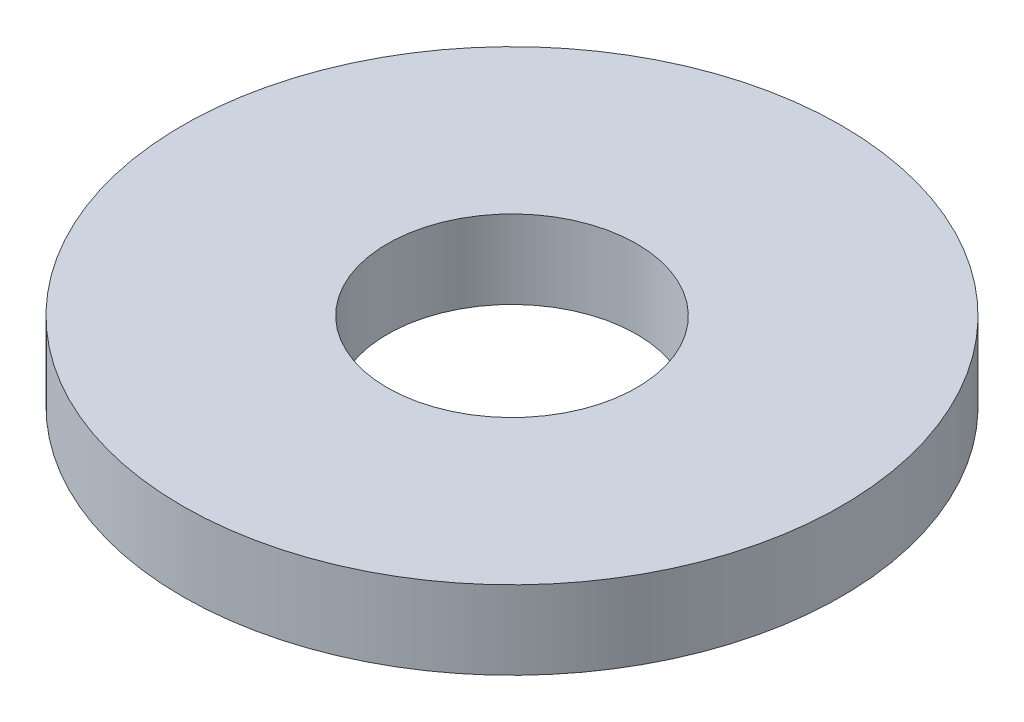
ISO-10303-21;
HEADER;
FILE_DESCRIPTION(('STEP AP214'),'2;1');
FILE_NAME('part.step','',(''),(''),'','','');
FILE_SCHEMA(('AUTOMOTIVE_DESIGN { 1 0 10303 214 1 1 1 1 }'));
ENDSEC;
DATA;
#1=APPLICATION_CONTEXT('core data for automotive mechanical design processes');
#2=APPLICATION_PROTOCOL_DEFINITION('international standard','automotive_design',2000,#1);
#3=PRODUCT_CONTEXT('',#1,'mechanical');
#4=PRODUCT('Part','Part','',(#3));
#5=PRODUCT_RELATED_PRODUCT_CATEGORY('part','',(#4));
#6=PRODUCT_DEFINITION_FORMATION('','',#4);
#7=PRODUCT_DEFINITION_CONTEXT('part definition',#1,'design');
#8=PRODUCT_DEFINITION('design','',#6,#7);
#9=PRODUCT_DEFINITION_SHAPE('','',#8);
#10=(LENGTH_UNIT() NAMED_UNIT(*) SI_UNIT(.MILLI.,.METRE.));
#11=(NAMED_UNIT(*) PLANE_ANGLE_UNIT() SI_UNIT($,.RADIAN.));
#12=(NAMED_UNIT(*) SI_UNIT($,.STERADIAN.) SOLID_ANGLE_UNIT());
#13=UNCERTAINTY_MEASURE_WITH_UNIT(LENGTH_MEASURE(1.E-05),#10,'distance_accuracy_value','');
#14=(GEOMETRIC_REPRESENTATION_CONTEXT(3) GLOBAL_UNCERTAINTY_ASSIGNED_CONTEXT((#13)) GLOBAL_UNIT_ASSIGNED_CONTEXT((#10,
#11,#12)) REPRESENTATION_CONTEXT('',''));
#15=CARTESIAN_POINT('',(0.,0.,0.));
#16=DIRECTION('',(0.,0.,1.));
#17=DIRECTION('',(1.,0.,0.));
#18=AXIS2_PLACEMENT_3D('',#15,#16,#17);
#19=CARTESIAN_POINT('',(0.,22.,0.));
#20=DIRECTION('',(0.,-1.,0.));
#21=DIRECTION('',(0.,0.,-1.));
#22=AXIS2_PLACEMENT_3D('',#19,#20,#21);
#23=CYLINDRICAL_SURFACE('',#22,92.5);
#24=CARTESIAN_POINT('',(0.,22.,0.));
#25=DIRECTION('',(0.,1.,0.));
#26=DIRECTION('',(0.,0.,1.));
#27=AXIS2_PLACEMENT_3D('',#24,#25,#26);
#28=CIRCLE('',#27,92.5);
#29=CARTESIAN_POINT('',(0.,22.,92.5));
#30=VERTEX_POINT('',#29);
#31=EDGE_CURVE('E10',#30,#30,#28,.T.);
#32=ORIENTED_EDGE('',*,*,#31,.F.);
#33=EDGE_LOOP('',(#32));
#34=FACE_BOUND('',#33,.T.);
#35=CARTESIAN_POINT('',(0.,0.,0.));
#36=DIRECTION('',(0.,1.,0.));
#37=DIRECTION('',(0.,0.,1.));
#38=AXIS2_PLACEMENT_3D('',#35,#36,#37);
#39=CIRCLE('',#38,92.5);
#40=CARTESIAN_POINT('',(0.,0.,92.5));
#41=VERTEX_POINT('',#40);
#42=EDGE_CURVE('E37',#41,#41,#39,.T.);
#43=ORIENTED_EDGE('',*,*,#42,.T.);
#44=EDGE_LOOP('',(#43));
#45=FACE_BOUND('',#44,.T.);
#46=ADVANCED_FACE('F40',(#34,#45),#23,.T.);
#47=CARTESIAN_POINT('',(0.,22.,0.));
#48=DIRECTION('',(0.,1.,0.));
#49=DIRECTION('',(0.,0.,1.));
#50=AXIS2_PLACEMENT_3D('',#47,#48,#49);
#51=PLANE('',#50);
#52=CARTESIAN_POINT('',(0.,22.,0.));
#53=DIRECTION('',(0.,1.,0.));
#54=DIRECTION('',(0.,0.,1.));
#55=AXIS2_PLACEMENT_3D('',#52,#53,#54);
#56=CIRCLE('',#55,35.);
#57=CARTESIAN_POINT('',(0.,22.,35.));
#58=VERTEX_POINT('',#57);
#59=EDGE_CURVE('E50',#58,#58,#56,.T.);
#60=ORIENTED_EDGE('',*,*,#59,.F.);
#61=EDGE_LOOP('',(#60));
#62=FACE_BOUND('',#61,.T.);
#63=ORIENTED_EDGE('',*,*,#31,.T.);
#64=EDGE_LOOP('',(#63));
#65=FACE_BOUND('',#64,.T.);
#66=ADVANCED_FACE('F59',(#62,#65),#51,.T.);
#67=CARTESIAN_POINT('',(0.,0.,0.));
#68=DIRECTION('',(0.,1.,0.));
#69=DIRECTION('',(0.,0.,1.));
#70=AXIS2_PLACEMENT_3D('',#67,#68,#69);
#71=PLANE('',#70);
#72=CARTESIAN_POINT('',(0.,0.,0.));
#73=DIRECTION('',(0.,1.,0.));
#74=DIRECTION('',(0.,0.,1.));
#75=AXIS2_PLACEMENT_3D('',#72,#73,#74);
#76=CIRCLE('',#75,35.);
#77=CARTESIAN_POINT('',(0.,0.,35.));
#78=VERTEX_POINT('',#77);
#79=EDGE_CURVE('E47',#78,#78,#76,.T.);
#80=ORIENTED_EDGE('',*,*,#79,.T.);
#81=EDGE_LOOP('',(#80));
#82=FACE_BOUND('',#81,.T.);
#83=ORIENTED_EDGE('',*,*,#42,.F.);
#84=EDGE_LOOP('',(#83));
#85=FACE_BOUND('',#84,.T.);
#86=ADVANCED_FACE('F58',(#82,#85),#71,.F.);
#87=CARTESIAN_POINT('',(0.,22.,0.));
#88=DIRECTION('',(0.,-1.,0.));
#89=DIRECTION('',(0.,0.,-1.));
#90=AXIS2_PLACEMENT_3D('',#87,#88,#89);
#91=CYLINDRICAL_SURFACE('',#90,35.);
#92=ORIENTED_EDGE('',*,*,#59,.T.);
#93=EDGE_LOOP('',(#92));
#94=FACE_BOUND('',#93,.T.);
#95=ORIENTED_EDGE('',*,*,#79,.F.);
#96=EDGE_LOOP('',(#95));
#97=FACE_BOUND('',#96,.T.);
#98=ADVANCED_FACE('F54',(#94,#97),#91,.F.);
#99=CLOSED_SHELL('',(#46,#66,#86,#98));
#100=MANIFOLD_SOLID_BREP('B2',#99);
#101=ADVANCED_BREP_SHAPE_REPRESENTATION('',(#18,#100),#14);
#102=SHAPE_DEFINITION_REPRESENTATION(#9,#101);
ENDSEC;
END-ISO-10303-21;
